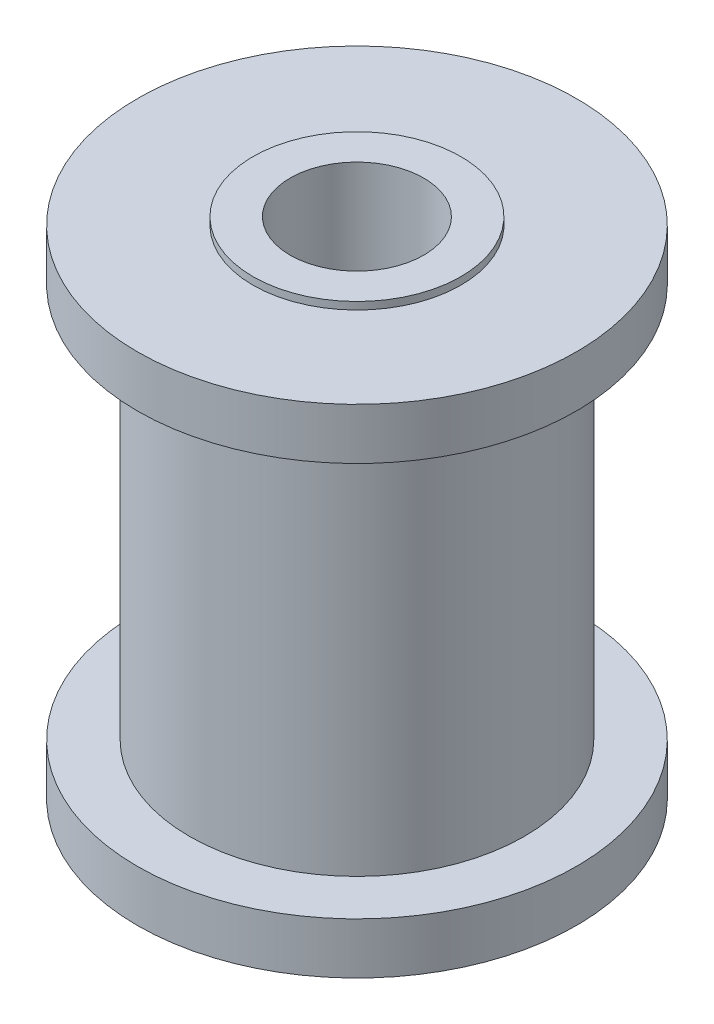
ISO-10303-21;
HEADER;
FILE_DESCRIPTION(('STEP AP214'),'2;1');
FILE_NAME('part.step','',(''),(''),'','','');
FILE_SCHEMA(('AUTOMOTIVE_DESIGN { 1 0 10303 214 1 1 1 1 }'));
ENDSEC;
DATA;
#1=APPLICATION_CONTEXT('core data for automotive mechanical design processes');
#2=APPLICATION_PROTOCOL_DEFINITION('international standard','automotive_design',2000,#1);
#3=PRODUCT_CONTEXT('',#1,'mechanical');
#4=PRODUCT('Part','Part','',(#3));
#5=PRODUCT_RELATED_PRODUCT_CATEGORY('part','',(#4));
#6=PRODUCT_DEFINITION_FORMATION('','',#4);
#7=PRODUCT_DEFINITION_CONTEXT('part definition',#1,'design');
#8=PRODUCT_DEFINITION('design','',#6,#7);
#9=PRODUCT_DEFINITION_SHAPE('','',#8);
#10=(LENGTH_UNIT() NAMED_UNIT(*) SI_UNIT(.MILLI.,.METRE.));
#11=(NAMED_UNIT(*) PLANE_ANGLE_UNIT() SI_UNIT($,.RADIAN.));
#12=(NAMED_UNIT(*) SI_UNIT($,.STERADIAN.) SOLID_ANGLE_UNIT());
#13=UNCERTAINTY_MEASURE_WITH_UNIT(LENGTH_MEASURE(1.E-05),#10,'distance_accuracy_value','');
#14=(GEOMETRIC_REPRESENTATION_CONTEXT(3) GLOBAL_UNCERTAINTY_ASSIGNED_CONTEXT((#13)) GLOBAL_UNIT_ASSIGNED_CONTEXT((#10,
#11,#12)) REPRESENTATION_CONTEXT('',''));
#15=CARTESIAN_POINT('',(0.,0.,0.));
#16=DIRECTION('',(0.,0.,1.));
#17=DIRECTION('',(1.,0.,0.));
#18=AXIS2_PLACEMENT_3D('',#15,#16,#17);
#19=CARTESIAN_POINT('',(0.,55.,0.));
#20=DIRECTION('',(0.,1.,0.));
#21=DIRECTION('',(0.,0.,1.));
#22=AXIS2_PLACEMENT_3D('',#19,#20,#21);
#23=CYLINDRICAL_SURFACE('',#22,2.28599999999999);
#24=CARTESIAN_POINT('',(0.,-16.51,0.));
#25=DIRECTION('',(0.,1.,0.));
#26=DIRECTION('',(0.,0.,1.));
#27=AXIS2_PLACEMENT_3D('',#24,#25,#26);
#28=CIRCLE('',#27,2.28599999999999);
#29=CARTESIAN_POINT('',(0.,-16.51,2.28599999999999));
#30=VERTEX_POINT('',#29);
#31=EDGE_CURVE('E71',#30,#30,#28,.T.);
#32=ORIENTED_EDGE('',*,*,#31,.F.);
#33=EDGE_LOOP('',(#32));
#34=FACE_BOUND('',#33,.T.);
#35=CARTESIAN_POINT('',(0.,0.990599999999994,0.));
#36=DIRECTION('',(0.,1.,0.));
#37=DIRECTION('',(0.,0.,1.));
#38=AXIS2_PLACEMENT_3D('',#35,#36,#37);
#39=CIRCLE('',#38,2.28599999999999);
#40=CARTESIAN_POINT('',(0.,0.990599999999994,2.28599999999999));
#41=VERTEX_POINT('',#40);
#42=EDGE_CURVE('E10',#41,#41,#39,.T.);
#43=ORIENTED_EDGE('',*,*,#42,.T.);
#44=EDGE_LOOP('',(#43));
#45=FACE_BOUND('',#44,.T.);
#46=ADVANCED_FACE('F31',(#34,#45),#23,.F.);
#47=CARTESIAN_POINT('',(0.,0.990599999999991,-2.28599999999999));
#48=DIRECTION('',(0.,-1.,0.));
#49=DIRECTION('',(0.,0.,-1.));
#50=AXIS2_PLACEMENT_3D('',#47,#48,#49);
#51=PLANE('',#50);
#52=ORIENTED_EDGE('',*,*,#42,.F.);
#53=EDGE_LOOP('',(#52));
#54=FACE_BOUND('',#53,.T.);
#55=CARTESIAN_POINT('',(0.,0.990599999999994,0.));
#56=DIRECTION('',(0.,1.,0.));
#57=DIRECTION('',(0.,0.,1.));
#58=AXIS2_PLACEMENT_3D('',#55,#56,#57);
#59=CIRCLE('',#58,3.556);
#60=CARTESIAN_POINT('',(0.,0.990599999999994,3.556));
#61=VERTEX_POINT('',#60);
#62=EDGE_CURVE('E37',#61,#61,#59,.T.);
#63=ORIENTED_EDGE('',*,*,#62,.T.);
#64=EDGE_LOOP('',(#63));
#65=FACE_BOUND('',#64,.T.);
#66=ADVANCED_FACE('F78',(#54,#65),#51,.F.);
#67=CARTESIAN_POINT('',(0.,55.,0.));
#68=DIRECTION('',(0.,1.,0.));
#69=DIRECTION('',(0.,0.,1.));
#70=AXIS2_PLACEMENT_3D('',#67,#68,#69);
#71=CYLINDRICAL_SURFACE('',#70,3.556);
#72=ORIENTED_EDGE('',*,*,#62,.F.);
#73=EDGE_LOOP('',(#72));
#74=FACE_BOUND('',#73,.T.);
#75=CARTESIAN_POINT('',(0.,0.73659999999999,0.));
#76=DIRECTION('',(0.,1.,0.));
#77=DIRECTION('',(0.,0.,1.));
#78=AXIS2_PLACEMENT_3D('',#75,#76,#77);
#79=CIRCLE('',#78,3.556);
#80=CARTESIAN_POINT('',(0.,0.73659999999999,3.556));
#81=VERTEX_POINT('',#80);
#82=EDGE_CURVE('E41',#81,#81,#79,.T.);
#83=ORIENTED_EDGE('',*,*,#82,.T.);
#84=EDGE_LOOP('',(#83));
#85=FACE_BOUND('',#84,.T.);
#86=ADVANCED_FACE('F82',(#74,#85),#71,.T.);
#87=CARTESIAN_POINT('',(0.,0.736599999999992,-3.556));
#88=DIRECTION('',(0.,-1.,0.));
#89=DIRECTION('',(0.,0.,-1.));
#90=AXIS2_PLACEMENT_3D('',#87,#88,#89);
#91=PLANE('',#90);
#92=ORIENTED_EDGE('',*,*,#82,.F.);
#93=EDGE_LOOP('',(#92));
#94=FACE_BOUND('',#93,.T.);
#95=CARTESIAN_POINT('',(0.,0.73659999999999,0.));
#96=DIRECTION('',(0.,1.,0.));
#97=DIRECTION('',(0.,0.,1.));
#98=AXIS2_PLACEMENT_3D('',#95,#96,#97);
#99=CIRCLE('',#98,7.5057);
#100=CARTESIAN_POINT('',(0.,0.73659999999999,7.5057));
#101=VERTEX_POINT('',#100);
#102=EDGE_CURVE('E45',#101,#101,#99,.T.);
#103=ORIENTED_EDGE('',*,*,#102,.T.);
#104=EDGE_LOOP('',(#103));
#105=FACE_BOUND('',#104,.T.);
#106=ADVANCED_FACE('F87',(#94,#105),#91,.F.);
#107=CARTESIAN_POINT('',(0.,55.,0.));
#108=DIRECTION('',(0.,1.,0.));
#109=DIRECTION('',(0.,0.,1.));
#110=AXIS2_PLACEMENT_3D('',#107,#108,#109);
#111=CYLINDRICAL_SURFACE('',#110,7.5057);
#112=ORIENTED_EDGE('',*,*,#102,.F.);
#113=EDGE_LOOP('',(#112));
#114=FACE_BOUND('',#113,.T.);
#115=CARTESIAN_POINT('',(0.,-1.01600000000001,0.));
#116=DIRECTION('',(0.,1.,0.));
#117=DIRECTION('',(0.,0.,1.));
#118=AXIS2_PLACEMENT_3D('',#115,#116,#117);
#119=CIRCLE('',#118,7.5057);
#120=CARTESIAN_POINT('',(0.,-1.01600000000001,7.5057));
#121=VERTEX_POINT('',#120);
#122=EDGE_CURVE('E50',#121,#121,#119,.T.);
#123=ORIENTED_EDGE('',*,*,#122,.T.);
#124=EDGE_LOOP('',(#123));
#125=FACE_BOUND('',#124,.T.);
#126=ADVANCED_FACE('F93',(#114,#125),#111,.T.);
#127=CARTESIAN_POINT('',(0.,-1.01600000000001,-5.7277));
#128=DIRECTION('',(0.,1.,0.));
#129=DIRECTION('',(0.,0.,1.));
#130=AXIS2_PLACEMENT_3D('',#127,#128,#129);
#131=PLANE('',#130);
#132=ORIENTED_EDGE('',*,*,#122,.F.);
#133=EDGE_LOOP('',(#132));
#134=FACE_BOUND('',#133,.T.);
#135=CARTESIAN_POINT('',(0.,-1.01600000000001,0.));
#136=DIRECTION('',(0.,1.,0.));
#137=DIRECTION('',(0.,0.,1.));
#138=AXIS2_PLACEMENT_3D('',#135,#136,#137);
#139=CIRCLE('',#138,5.7277);
#140=CARTESIAN_POINT('',(0.,-1.01600000000001,5.7277));
#141=VERTEX_POINT('',#140);
#142=EDGE_CURVE('E53',#141,#141,#139,.T.);
#143=ORIENTED_EDGE('',*,*,#142,.T.);
#144=EDGE_LOOP('',(#143));
#145=FACE_BOUND('',#144,.T.);
#146=ADVANCED_FACE('F97',(#134,#145),#131,.F.);
#147=CARTESIAN_POINT('',(0.,55.,0.));
#148=DIRECTION('',(0.,1.,0.));
#149=DIRECTION('',(0.,0.,1.));
#150=AXIS2_PLACEMENT_3D('',#147,#148,#149);
#151=CYLINDRICAL_SURFACE('',#150,5.7277);
#152=ORIENTED_EDGE('',*,*,#142,.F.);
#153=EDGE_LOOP('',(#152));
#154=FACE_BOUND('',#153,.T.);
#155=CARTESIAN_POINT('',(0.,-14.5034,0.));
#156=DIRECTION('',(0.,1.,0.));
#157=DIRECTION('',(0.,0.,1.));
#158=AXIS2_PLACEMENT_3D('',#155,#156,#157);
#159=CIRCLE('',#158,5.7277);
#160=CARTESIAN_POINT('',(0.,-14.5034,5.7277));
#161=VERTEX_POINT('',#160);
#162=EDGE_CURVE('E56',#161,#161,#159,.T.);
#163=ORIENTED_EDGE('',*,*,#162,.T.);
#164=EDGE_LOOP('',(#163));
#165=FACE_BOUND('',#164,.T.);
#166=ADVANCED_FACE('F101',(#154,#165),#151,.T.);
#167=CARTESIAN_POINT('',(0.,-14.5034,-5.7277));
#168=DIRECTION('',(0.,-1.,0.));
#169=DIRECTION('',(0.,0.,-1.));
#170=AXIS2_PLACEMENT_3D('',#167,#168,#169);
#171=PLANE('',#170);
#172=ORIENTED_EDGE('',*,*,#162,.F.);
#173=EDGE_LOOP('',(#172));
#174=FACE_BOUND('',#173,.T.);
#175=CARTESIAN_POINT('',(0.,-14.5034,0.));
#176=DIRECTION('',(0.,1.,0.));
#177=DIRECTION('',(0.,0.,1.));
#178=AXIS2_PLACEMENT_3D('',#175,#176,#177);
#179=CIRCLE('',#178,7.5057);
#180=CARTESIAN_POINT('',(0.,-14.5034,7.5057));
#181=VERTEX_POINT('',#180);
#182=EDGE_CURVE('E59',#181,#181,#179,.T.);
#183=ORIENTED_EDGE('',*,*,#182,.T.);
#184=EDGE_LOOP('',(#183));
#185=FACE_BOUND('',#184,.T.);
#186=ADVANCED_FACE('F105',(#174,#185),#171,.F.);
#187=CARTESIAN_POINT('',(0.,55.,0.));
#188=DIRECTION('',(0.,1.,0.));
#189=DIRECTION('',(0.,0.,1.));
#190=AXIS2_PLACEMENT_3D('',#187,#188,#189);
#191=CYLINDRICAL_SURFACE('',#190,7.5057);
#192=ORIENTED_EDGE('',*,*,#182,.F.);
#193=EDGE_LOOP('',(#192));
#194=FACE_BOUND('',#193,.T.);
#195=CARTESIAN_POINT('',(0.,-16.256,0.));
#196=DIRECTION('',(0.,1.,0.));
#197=DIRECTION('',(0.,0.,1.));
#198=AXIS2_PLACEMENT_3D('',#195,#196,#197);
#199=CIRCLE('',#198,7.5057);
#200=CARTESIAN_POINT('',(0.,-16.256,7.5057));
#201=VERTEX_POINT('',#200);
#202=EDGE_CURVE('E62',#201,#201,#199,.T.);
#203=ORIENTED_EDGE('',*,*,#202,.T.);
#204=EDGE_LOOP('',(#203));
#205=FACE_BOUND('',#204,.T.);
#206=ADVANCED_FACE('F109',(#194,#205),#191,.T.);
#207=CARTESIAN_POINT('',(0.,-16.256,-7.5057));
#208=DIRECTION('',(0.,1.,0.));
#209=DIRECTION('',(0.,0.,1.));
#210=AXIS2_PLACEMENT_3D('',#207,#208,#209);
#211=PLANE('',#210);
#212=ORIENTED_EDGE('',*,*,#202,.F.);
#213=EDGE_LOOP('',(#212));
#214=FACE_BOUND('',#213,.T.);
#215=CARTESIAN_POINT('',(0.,-16.256,0.));
#216=DIRECTION('',(0.,1.,0.));
#217=DIRECTION('',(0.,0.,1.));
#218=AXIS2_PLACEMENT_3D('',#215,#216,#217);
#219=CIRCLE('',#218,3.556);
#220=CARTESIAN_POINT('',(0.,-16.256,3.556));
#221=VERTEX_POINT('',#220);
#222=EDGE_CURVE('E65',#221,#221,#219,.T.);
#223=ORIENTED_EDGE('',*,*,#222,.T.);
#224=EDGE_LOOP('',(#223));
#225=FACE_BOUND('',#224,.T.);
#226=ADVANCED_FACE('F113',(#214,#225),#211,.F.);
#227=CARTESIAN_POINT('',(0.,55.,0.));
#228=DIRECTION('',(0.,1.,0.));
#229=DIRECTION('',(0.,0.,1.));
#230=AXIS2_PLACEMENT_3D('',#227,#228,#229);
#231=CYLINDRICAL_SURFACE('',#230,3.556);
#232=ORIENTED_EDGE('',*,*,#222,.F.);
#233=EDGE_LOOP('',(#232));
#234=FACE_BOUND('',#233,.T.);
#235=CARTESIAN_POINT('',(0.,-16.51,0.));
#236=DIRECTION('',(0.,1.,0.));
#237=DIRECTION('',(0.,0.,1.));
#238=AXIS2_PLACEMENT_3D('',#235,#236,#237);
#239=CIRCLE('',#238,3.556);
#240=CARTESIAN_POINT('',(0.,-16.51,3.556));
#241=VERTEX_POINT('',#240);
#242=EDGE_CURVE('E68',#241,#241,#239,.T.);
#243=ORIENTED_EDGE('',*,*,#242,.T.);
#244=EDGE_LOOP('',(#243));
#245=FACE_BOUND('',#244,.T.);
#246=ADVANCED_FACE('F117',(#234,#245),#231,.T.);
#247=CARTESIAN_POINT('',(0.,-16.51,-3.556));
#248=DIRECTION('',(0.,1.,0.));
#249=DIRECTION('',(0.,0.,1.));
#250=AXIS2_PLACEMENT_3D('',#247,#248,#249);
#251=PLANE('',#250);
#252=ORIENTED_EDGE('',*,*,#242,.F.);
#253=EDGE_LOOP('',(#252));
#254=FACE_BOUND('',#253,.T.);
#255=ORIENTED_EDGE('',*,*,#31,.T.);
#256=EDGE_LOOP('',(#255));
#257=FACE_BOUND('',#256,.T.);
#258=ADVANCED_FACE('F75',(#254,#257),#251,.F.);
#259=CLOSED_SHELL('',(#46,#66,#86,#106,#126,#146,#166,#186,#206,#226,#246,#258));
#260=MANIFOLD_SOLID_BREP('B2',#259);
#261=ADVANCED_BREP_SHAPE_REPRESENTATION('',(#18,#260),#14);
#262=SHAPE_DEFINITION_REPRESENTATION(#9,#261);
ENDSEC;
END-ISO-10303-21;
